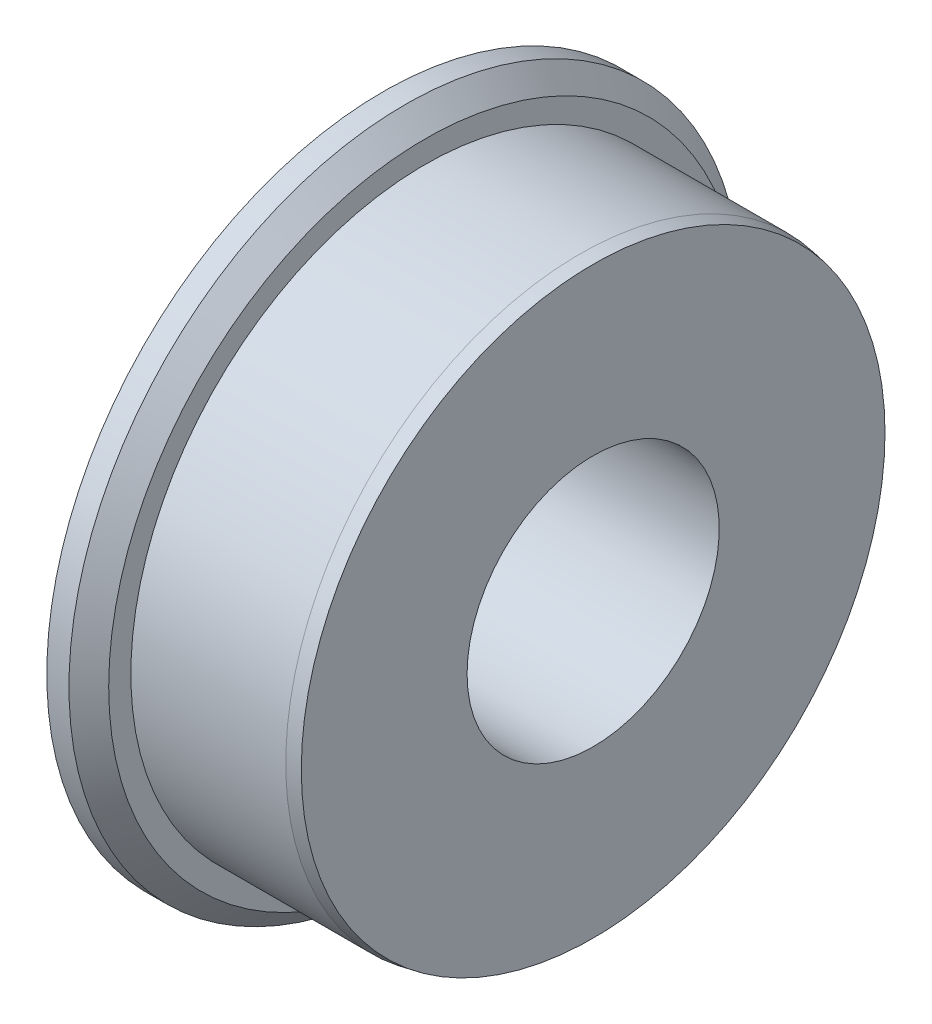
ISO-10303-21;
HEADER;
FILE_DESCRIPTION(('STEP AP214'),'2;1');
FILE_NAME('part.step','',(''),(''),'','','');
FILE_SCHEMA(('AUTOMOTIVE_DESIGN { 1 0 10303 214 1 1 1 1 }'));
ENDSEC;
DATA;
#1=APPLICATION_CONTEXT('core data for automotive mechanical design processes');
#2=APPLICATION_PROTOCOL_DEFINITION('international standard','automotive_design',2000,#1);
#3=PRODUCT_CONTEXT('',#1,'mechanical');
#4=PRODUCT('Part','Part','',(#3));
#5=PRODUCT_RELATED_PRODUCT_CATEGORY('part','',(#4));
#6=PRODUCT_DEFINITION_FORMATION('','',#4);
#7=PRODUCT_DEFINITION_CONTEXT('part definition',#1,'design');
#8=PRODUCT_DEFINITION('design','',#6,#7);
#9=PRODUCT_DEFINITION_SHAPE('','',#8);
#10=(LENGTH_UNIT() NAMED_UNIT(*) SI_UNIT(.MILLI.,.METRE.));
#11=(NAMED_UNIT(*) PLANE_ANGLE_UNIT() SI_UNIT($,.RADIAN.));
#12=(NAMED_UNIT(*) SI_UNIT($,.STERADIAN.) SOLID_ANGLE_UNIT());
#13=UNCERTAINTY_MEASURE_WITH_UNIT(LENGTH_MEASURE(1.E-05),#10,'distance_accuracy_value','');
#14=(GEOMETRIC_REPRESENTATION_CONTEXT(3) GLOBAL_UNCERTAINTY_ASSIGNED_CONTEXT((#13)) GLOBAL_UNIT_ASSIGNED_CONTEXT((#10,
#11,#12)) REPRESENTATION_CONTEXT('',''));
#15=CARTESIAN_POINT('',(0.,0.,0.));
#16=DIRECTION('',(0.,0.,1.));
#17=DIRECTION('',(1.,0.,0.));
#18=AXIS2_PLACEMENT_3D('',#15,#16,#17);
#19=CARTESIAN_POINT('',(3.175,0.,0.));
#20=DIRECTION('',(-1.,0.,0.));
#21=DIRECTION('',(0.,0.,1.));
#22=AXIS2_PLACEMENT_3D('',#19,#20,#21);
#23=CYLINDRICAL_SURFACE('',#22,25.4);
#24=CARTESIAN_POINT('',(1.675,0.,0.));
#25=DIRECTION('',(1.,0.,0.));
#26=DIRECTION('',(0.,0.,-1.));
#27=AXIS2_PLACEMENT_3D('',#24,#25,#26);
#28=CIRCLE('',#27,25.4);
#29=CARTESIAN_POINT('',(1.675,0.,-25.4));
#30=VERTEX_POINT('',#29);
#31=EDGE_CURVE('E10',#30,#30,#28,.F.);
#32=ORIENTED_EDGE('',*,*,#31,.T.);
#33=EDGE_LOOP('',(#32));
#34=FACE_BOUND('',#33,.T.);
#35=CARTESIAN_POINT('',(0.,0.,0.));
#36=DIRECTION('',(1.,0.,0.));
#37=DIRECTION('',(0.,0.,-1.));
#38=AXIS2_PLACEMENT_3D('',#35,#36,#37);
#39=CIRCLE('',#38,25.4);
#40=CARTESIAN_POINT('',(0.,0.,-25.4));
#41=VERTEX_POINT('',#40);
#42=EDGE_CURVE('E65',#41,#41,#39,.T.);
#43=ORIENTED_EDGE('',*,*,#42,.T.);
#44=EDGE_LOOP('',(#43));
#45=FACE_BOUND('',#44,.T.);
#46=ADVANCED_FACE('F39',(#34,#45),#23,.T.);
#47=CARTESIAN_POINT('',(3.175,0.,0.));
#48=DIRECTION('',(1.,0.,0.));
#49=DIRECTION('',(0.,0.,-1.));
#50=AXIS2_PLACEMENT_3D('',#47,#48,#49);
#51=PLANE('',#50);
#52=CARTESIAN_POINT('',(3.175,0.,0.));
#53=DIRECTION('',(1.,0.,0.));
#54=DIRECTION('',(0.,0.,-1.));
#55=AXIS2_PLACEMENT_3D('',#52,#53,#54);
#56=CIRCLE('',#55,23.9);
#57=CARTESIAN_POINT('',(3.175,0.,-23.9));
#58=VERTEX_POINT('',#57);
#59=EDGE_CURVE('E48',#58,#58,#56,.T.);
#60=ORIENTED_EDGE('',*,*,#59,.T.);
#61=EDGE_LOOP('',(#60));
#62=FACE_BOUND('',#61,.T.);
#63=CARTESIAN_POINT('',(3.175,0.,0.));
#64=DIRECTION('',(1.,0.,0.));
#65=DIRECTION('',(0.,0.,-1.));
#66=AXIS2_PLACEMENT_3D('',#63,#64,#65);
#67=CIRCLE('',#66,22.225);
#68=CARTESIAN_POINT('',(3.175,0.,-22.225));
#69=VERTEX_POINT('',#68);
#70=EDGE_CURVE('E64',#69,#69,#67,.T.);
#71=ORIENTED_EDGE('',*,*,#70,.F.);
#72=EDGE_LOOP('',(#71));
#73=FACE_BOUND('',#72,.T.);
#74=ADVANCED_FACE('F94',(#62,#73),#51,.T.);
#75=CARTESIAN_POINT('',(0.,0.,0.));
#76=DIRECTION('',(1.,0.,0.));
#77=DIRECTION('',(0.,0.,-1.));
#78=AXIS2_PLACEMENT_3D('',#75,#76,#77);
#79=PLANE('',#78);
#80=CARTESIAN_POINT('',(0.,0.,0.));
#81=DIRECTION('',(-1.,0.,0.));
#82=DIRECTION('',(0.,0.,1.));
#83=AXIS2_PLACEMENT_3D('',#80,#81,#82);
#84=CIRCLE('',#83,9.525);
#85=CARTESIAN_POINT('',(0.,0.,9.525));
#86=VERTEX_POINT('',#85);
#87=EDGE_CURVE('E73',#86,#86,#84,.T.);
#88=ORIENTED_EDGE('',*,*,#87,.F.);
#89=EDGE_LOOP('',(#88));
#90=FACE_BOUND('',#89,.T.);
#91=ORIENTED_EDGE('',*,*,#42,.F.);
#92=EDGE_LOOP('',(#91));
#93=FACE_BOUND('',#92,.T.);
#94=ADVANCED_FACE('F90',(#90,#93),#79,.F.);
#95=CARTESIAN_POINT('',(15.875,0.,0.));
#96=DIRECTION('',(-1.,0.,0.));
#97=DIRECTION('',(0.,0.,1.));
#98=AXIS2_PLACEMENT_3D('',#95,#96,#97);
#99=CYLINDRICAL_SURFACE('',#98,22.225);
#100=CARTESIAN_POINT('',(14.8749999999999,0.,0.));
#101=DIRECTION('',(1.,0.,0.));
#102=DIRECTION('',(0.,0.,-1.));
#103=AXIS2_PLACEMENT_3D('',#100,#101,#102);
#104=CIRCLE('',#103,22.225);
#105=CARTESIAN_POINT('',(14.8749999999999,0.,-22.225));
#106=VERTEX_POINT('',#105);
#107=EDGE_CURVE('E53',#106,#106,#104,.F.);
#108=ORIENTED_EDGE('',*,*,#107,.T.);
#109=EDGE_LOOP('',(#108));
#110=FACE_BOUND('',#109,.T.);
#111=ORIENTED_EDGE('',*,*,#70,.T.);
#112=EDGE_LOOP('',(#111));
#113=FACE_BOUND('',#112,.T.);
#114=ADVANCED_FACE('F93',(#110,#113),#99,.T.);
#115=CARTESIAN_POINT('',(15.875,0.,0.));
#116=DIRECTION('',(1.,0.,0.));
#117=DIRECTION('',(0.,0.,-1.));
#118=AXIS2_PLACEMENT_3D('',#115,#116,#117);
#119=PLANE('',#118);
#120=CARTESIAN_POINT('',(15.875,0.,0.));
#121=DIRECTION('',(1.,0.,0.));
#122=DIRECTION('',(0.,0.,-1.));
#123=AXIS2_PLACEMENT_3D('',#120,#121,#122);
#124=CIRCLE('',#123,22.0486730192915);
#125=CARTESIAN_POINT('',(15.875,0.,-22.0486730192915));
#126=VERTEX_POINT('',#125);
#127=EDGE_CURVE('E58',#126,#126,#124,.T.);
#128=ORIENTED_EDGE('',*,*,#127,.T.);
#129=EDGE_LOOP('',(#128));
#130=FACE_BOUND('',#129,.T.);
#131=CARTESIAN_POINT('',(15.875,0.,0.));
#132=DIRECTION('',(-1.,0.,0.));
#133=DIRECTION('',(0.,0.,1.));
#134=AXIS2_PLACEMENT_3D('',#131,#132,#133);
#135=CIRCLE('',#134,9.525);
#136=CARTESIAN_POINT('',(15.875,0.,9.525));
#137=VERTEX_POINT('',#136);
#138=EDGE_CURVE('E69',#137,#137,#135,.T.);
#139=ORIENTED_EDGE('',*,*,#138,.T.);
#140=EDGE_LOOP('',(#139));
#141=FACE_BOUND('',#140,.T.);
#142=ADVANCED_FACE('F81',(#130,#141),#119,.T.);
#143=CARTESIAN_POINT('',(15.875,0.,0.));
#144=DIRECTION('',(-1.,0.,0.));
#145=DIRECTION('',(0.,0.,1.));
#146=AXIS2_PLACEMENT_3D('',#143,#144,#145);
#147=CYLINDRICAL_SURFACE('',#146,9.525);
#148=ORIENTED_EDGE('',*,*,#138,.F.);
#149=EDGE_LOOP('',(#148));
#150=FACE_BOUND('',#149,.T.);
#151=ORIENTED_EDGE('',*,*,#87,.T.);
#152=EDGE_LOOP('',(#151));
#153=FACE_BOUND('',#152,.T.);
#154=ADVANCED_FACE('F83',(#150,#153),#147,.F.);
#155=CARTESIAN_POINT('',(15.875,0.,0.));
#156=DIRECTION('',(-1.,0.,0.));
#157=DIRECTION('',(0.,0.,1.));
#158=AXIS2_PLACEMENT_3D('',#155,#156,#157);
#159=CONICAL_SURFACE('',#158,22.0486730192915,0.174532925199432);
#160=ORIENTED_EDGE('',*,*,#107,.F.);
#161=EDGE_LOOP('',(#160));
#162=FACE_BOUND('',#161,.T.);
#163=ORIENTED_EDGE('',*,*,#127,.F.);
#164=EDGE_LOOP('',(#163));
#165=FACE_BOUND('',#164,.T.);
#166=ADVANCED_FACE('F86',(#162,#165),#159,.T.);
#167=CARTESIAN_POINT('',(3.175,0.,0.));
#168=DIRECTION('',(-1.,0.,0.));
#169=DIRECTION('',(0.,0.,1.));
#170=AXIS2_PLACEMENT_3D('',#167,#168,#169);
#171=CONICAL_SURFACE('',#170,23.9,0.785398163397443);
#172=ORIENTED_EDGE('',*,*,#31,.F.);
#173=EDGE_LOOP('',(#172));
#174=FACE_BOUND('',#173,.T.);
#175=ORIENTED_EDGE('',*,*,#59,.F.);
#176=EDGE_LOOP('',(#175));
#177=FACE_BOUND('',#176,.T.);
#178=ADVANCED_FACE('F42',(#174,#177),#171,.T.);
#179=CLOSED_SHELL('',(#46,#74,#94,#114,#142,#154,#166,#178));
#180=MANIFOLD_SOLID_BREP('B2',#179);
#181=ADVANCED_BREP_SHAPE_REPRESENTATION('',(#18,#180),#14);
#182=SHAPE_DEFINITION_REPRESENTATION(#9,#181);
ENDSEC;
END-ISO-10303-21;
